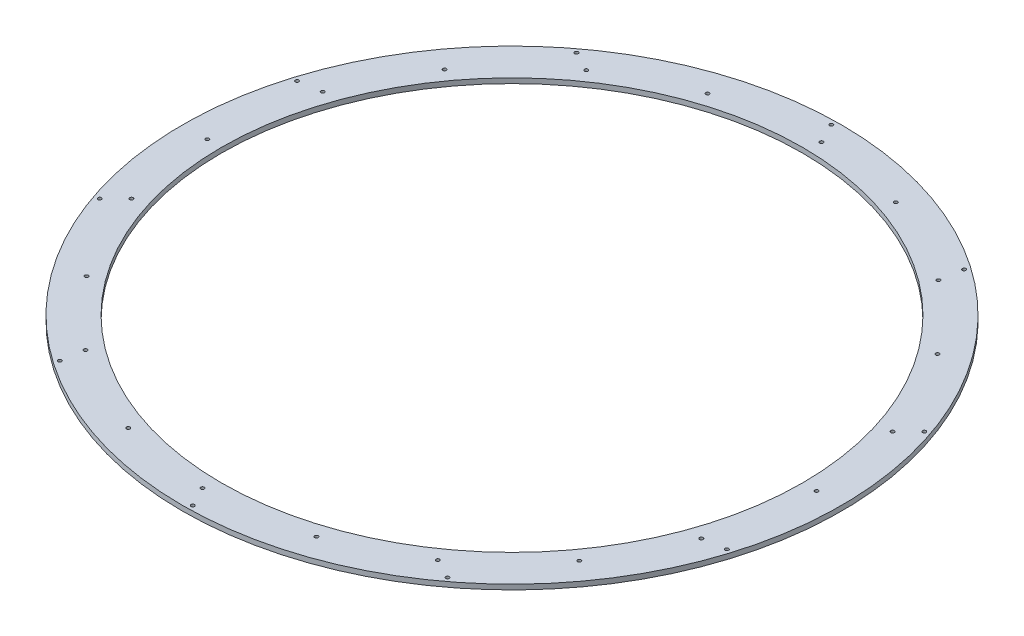
ISO-10303-21;
HEADER;
FILE_DESCRIPTION(('STEP AP214'),'2;1');
FILE_NAME('part.step','',(''),(''),'','','');
FILE_SCHEMA(('AUTOMOTIVE_DESIGN { 1 0 10303 214 1 1 1 1 }'));
ENDSEC;
DATA;
#1=APPLICATION_CONTEXT('core data for automotive mechanical design processes');
#2=APPLICATION_PROTOCOL_DEFINITION('international standard','automotive_design',2000,#1);
#3=PRODUCT_CONTEXT('',#1,'mechanical');
#4=PRODUCT('Part','Part','',(#3));
#5=PRODUCT_RELATED_PRODUCT_CATEGORY('part','',(#4));
#6=PRODUCT_DEFINITION_FORMATION('','',#4);
#7=PRODUCT_DEFINITION_CONTEXT('part definition',#1,'design');
#8=PRODUCT_DEFINITION('design','',#6,#7);
#9=PRODUCT_DEFINITION_SHAPE('','',#8);
#10=(LENGTH_UNIT() NAMED_UNIT(*) SI_UNIT(.MILLI.,.METRE.));
#11=(NAMED_UNIT(*) PLANE_ANGLE_UNIT() SI_UNIT($,.RADIAN.));
#12=(NAMED_UNIT(*) SI_UNIT($,.STERADIAN.) SOLID_ANGLE_UNIT());
#13=UNCERTAINTY_MEASURE_WITH_UNIT(LENGTH_MEASURE(1.E-05),#10,'distance_accuracy_value','');
#14=(GEOMETRIC_REPRESENTATION_CONTEXT(3) GLOBAL_UNCERTAINTY_ASSIGNED_CONTEXT((#13)) GLOBAL_UNIT_ASSIGNED_CONTEXT((#10,
#11,#12)) REPRESENTATION_CONTEXT('',''));
#15=CARTESIAN_POINT('',(0.,0.,0.));
#16=DIRECTION('',(0.,0.,1.));
#17=DIRECTION('',(1.,0.,0.));
#18=AXIS2_PLACEMENT_3D('',#15,#16,#17);
#19=CARTESIAN_POINT('',(0.,-5.,0.));
#20=DIRECTION('',(0.,1.,0.));
#21=DIRECTION('',(0.,0.,1.));
#22=AXIS2_PLACEMENT_3D('',#19,#20,#21);
#23=CYLINDRICAL_SURFACE('',#22,330.);
#24=CARTESIAN_POINT('',(0.,-5.,0.));
#25=DIRECTION('',(0.,1.,0.));
#26=DIRECTION('',(0.,0.,1.));
#27=AXIS2_PLACEMENT_3D('',#24,#25,#26);
#28=CIRCLE('',#27,330.);
#29=CARTESIAN_POINT('',(0.,-5.,330.));
#30=VERTEX_POINT('',#29);
#31=EDGE_CURVE('E10',#30,#30,#28,.T.);
#32=ORIENTED_EDGE('',*,*,#31,.T.);
#33=EDGE_LOOP('',(#32));
#34=FACE_BOUND('',#33,.T.);
#35=CARTESIAN_POINT('',(0.,0.,0.));
#36=DIRECTION('',(0.,1.,0.));
#37=DIRECTION('',(0.,0.,1.));
#38=AXIS2_PLACEMENT_3D('',#35,#36,#37);
#39=CIRCLE('',#38,330.);
#40=CARTESIAN_POINT('',(0.,0.,330.));
#41=VERTEX_POINT('',#40);
#42=EDGE_CURVE('E33',#41,#41,#39,.T.);
#43=ORIENTED_EDGE('',*,*,#42,.F.);
#44=EDGE_LOOP('',(#43));
#45=FACE_BOUND('',#44,.T.);
#46=ADVANCED_FACE('F30',(#34,#45),#23,.T.);
#47=CARTESIAN_POINT('',(0.,-5.,0.));
#48=DIRECTION('',(0.,1.,0.));
#49=DIRECTION('',(0.,0.,1.));
#50=AXIS2_PLACEMENT_3D('',#47,#48,#49);
#51=PLANE('',#50);
#52=CARTESIAN_POINT('',(-4.91615721260713,-5.,304.96037676764));
#53=DIRECTION('',(0.,1.,0.));
#54=DIRECTION('',(-0.587785252292462,0.,0.809016994374955));
#55=AXIS2_PLACEMENT_3D('',#52,#53,#54);
#56=CIRCLE('',#55,1.75000000000001);
#57=CARTESIAN_POINT('',(-5.94478140411895,-5.,306.376156507796));
#58=VERTEX_POINT('',#57);
#59=EDGE_CURVE('E219',#58,#58,#56,.T.);
#60=ORIENTED_EDGE('',*,*,#59,.T.);
#61=EDGE_LOOP('',(#60));
#62=FACE_BOUND('',#61,.T.);
#63=CARTESIAN_POINT('',(-94.250183284357,-5.,290.072237470022));
#64=DIRECTION('',(0.,1.,0.));
#65=DIRECTION('',(-0.587785252292462,0.,0.809016994374955));
#66=AXIS2_PLACEMENT_3D('',#63,#64,#65);
#67=CIRCLE('',#66,1.75);
#68=CARTESIAN_POINT('',(-95.2788074758688,-5.,291.488017210179));
#69=VERTEX_POINT('',#68);
#70=EDGE_CURVE('E213',#69,#69,#67,.T.);
#71=ORIENTED_EDGE('',*,*,#70,.T.);
#72=EDGE_LOOP('',(#71));
#73=FACE_BOUND('',#72,.T.);
#74=CARTESIAN_POINT('',(-186.767331512475,-5.,265.975494885731));
#75=DIRECTION('',(0.,1.,0.));
#76=DIRECTION('',(-0.587785252292462,0.,0.809016994374955));
#77=AXIS2_PLACEMENT_3D('',#74,#75,#76);
#78=CIRCLE('',#77,1.75);
#79=CARTESIAN_POINT('',(-187.795955703987,-5.,267.391274625887));
#80=VERTEX_POINT('',#79);
#81=EDGE_CURVE('E207',#80,#80,#78,.T.);
#82=ORIENTED_EDGE('',*,*,#81,.T.);
#83=EDGE_LOOP('',(#82));
#84=FACE_BOUND('',#83,.T.);
#85=CARTESIAN_POINT('',(-183.228466729594,-5.,243.828482708486));
#86=DIRECTION('',(0.,1.,0.));
#87=DIRECTION('',(-0.95105651629515,0.,0.309016994374958));
#88=AXIS2_PLACEMENT_3D('',#85,#86,#87);
#89=CIRCLE('',#88,1.75000000000001);
#90=CARTESIAN_POINT('',(-184.89281563311,-5.,244.369262448642));
#91=VERTEX_POINT('',#90);
#92=EDGE_CURVE('E201',#91,#91,#89,.T.);
#93=ORIENTED_EDGE('',*,*,#92,.T.);
#94=EDGE_LOOP('',(#93));
#95=FACE_BOUND('',#94,.T.);
#96=CARTESIAN_POINT('',(-246.750183284358,-5.,179.274501949206));
#97=DIRECTION('',(0.,1.,0.));
#98=DIRECTION('',(-0.95105651629515,0.,0.309016994374958));
#99=AXIS2_PLACEMENT_3D('',#96,#97,#98);
#100=CIRCLE('',#99,1.75);
#101=CARTESIAN_POINT('',(-248.414532187875,-5.,179.815281689362));
#102=VERTEX_POINT('',#101);
#103=EDGE_CURVE('E195',#102,#102,#100,.T.);
#104=ORIENTED_EDGE('',*,*,#103,.T.);
#105=EDGE_LOOP('',(#104));
#106=FACE_BOUND('',#105,.T.);
#107=CARTESIAN_POINT('',(-307.434418552677,-5.,105.39961237679));
#108=DIRECTION('',(0.,1.,0.));
#109=DIRECTION('',(-0.95105651629515,0.,0.309016994374958));
#110=AXIS2_PLACEMENT_3D('',#107,#108,#109);
#111=CIRCLE('',#110,1.75);
#112=CARTESIAN_POINT('',(-309.098767456193,-5.,105.940392116947));
#113=VERTEX_POINT('',#112);
#114=EDGE_CURVE('E189',#113,#113,#111,.T.);
#115=ORIENTED_EDGE('',*,*,#114,.T.);
#116=EDGE_LOOP('',(#115));
#117=FACE_BOUND('',#116,.T.);
#118=CARTESIAN_POINT('',(-291.553729662404,-5.,89.5623956800052));
#119=DIRECTION('',(0.,1.,0.));
#120=DIRECTION('',(-0.951056516295157,0.,-0.309016994374938));
#121=AXIS2_PLACEMENT_3D('',#118,#119,#120);
#122=CIRCLE('',#121,1.75000000000001);
#123=CARTESIAN_POINT('',(-293.218078565921,-5.,89.021615939849));
#124=VERTEX_POINT('',#123);
#125=EDGE_CURVE('E183',#124,#124,#122,.T.);
#126=ORIENTED_EDGE('',*,*,#125,.T.);
#127=EDGE_LOOP('',(#126));
#128=FACE_BOUND('',#127,.T.);
#129=CARTESIAN_POINT('',(-305.,-5.,9.85322934354826E-13));
#130=DIRECTION('',(0.,1.,0.));
#131=DIRECTION('',(-0.951056516295157,0.,-0.309016994374938));
#132=AXIS2_PLACEMENT_3D('',#129,#130,#131);
#133=CIRCLE('',#132,1.75);
#134=CARTESIAN_POINT('',(-306.664348903516,-5.,-0.540779740155156));
#135=VERTEX_POINT('',#134);
#136=EDGE_CURVE('E177',#135,#135,#133,.T.);
#137=ORIENTED_EDGE('',*,*,#136,.T.);
#138=EDGE_LOOP('',(#137));
#139=FACE_BOUND('',#138,.T.);
#140=CARTESIAN_POINT('',(-310.672007017316,-5.,-95.4353396590199));
#141=DIRECTION('',(0.,1.,0.));
#142=DIRECTION('',(-0.951056516295157,0.,-0.309016994374938));
#143=AXIS2_PLACEMENT_3D('',#140,#141,#142);
#144=CIRCLE('',#143,1.75);
#145=CARTESIAN_POINT('',(-312.336355920833,-5.,-95.9761193991761));
#146=VERTEX_POINT('',#145);
#147=EDGE_CURVE('E171',#146,#146,#144,.T.);
#148=ORIENTED_EDGE('',*,*,#147,.T.);
#149=EDGE_LOOP('',(#148));
#150=FACE_BOUND('',#149,.T.);
#151=CARTESIAN_POINT('',(-288.515377410974,-5.,-98.9134823843703));
#152=DIRECTION('',(0.,1.,0.));
#153=DIRECTION('',(-0.58778525229248,0.,-0.809016994374942));
#154=AXIS2_PLACEMENT_3D('',#151,#152,#153);
#155=CIRCLE('',#154,1.75000000000001);
#156=CARTESIAN_POINT('',(-289.544001602486,-5.,-100.329262124526));
#157=VERTEX_POINT('',#156);
#158=EDGE_CURVE('E165',#157,#157,#155,.T.);
#159=ORIENTED_EDGE('',*,*,#158,.T.);
#160=EDGE_LOOP('',(#159));
#161=FACE_BOUND('',#160,.T.);
#162=CARTESIAN_POINT('',(-246.750183284359,-5.,-179.274501949204));
#163=DIRECTION('',(0.,1.,0.));
#164=DIRECTION('',(-0.58778525229248,0.,-0.809016994374942));
#165=AXIS2_PLACEMENT_3D('',#162,#163,#164);
#166=CIRCLE('',#165,1.75);
#167=CARTESIAN_POINT('',(-247.778807475871,-5.,-180.69028168936));
#168=VERTEX_POINT('',#167);
#169=EDGE_CURVE('E159',#168,#168,#166,.T.);
#170=ORIENTED_EDGE('',*,*,#169,.T.);
#171=EDGE_LOOP('',(#170));
#172=FACE_BOUND('',#171,.T.);
#173=CARTESIAN_POINT('',(-195.243448154487,-5.,-259.817235672975));
#174=DIRECTION('',(0.,1.,0.));
#175=DIRECTION('',(-0.58778525229248,0.,-0.809016994374942));
#176=AXIS2_PLACEMENT_3D('',#173,#174,#175);
#177=CIRCLE('',#176,1.75);
#178=CARTESIAN_POINT('',(-196.272072345999,-5.,-261.233015413131));
#179=VERTEX_POINT('',#178);
#180=EDGE_CURVE('E153',#179,#179,#177,.T.);
#181=ORIENTED_EDGE('',*,*,#180,.T.);
#182=EDGE_LOOP('',(#181));
#183=FACE_BOUND('',#182,.T.);
#184=CARTESIAN_POINT('',(-175.273957265553,-5.,-249.607772123532));
#185=DIRECTION('',(0.,1.,0.));
#186=DIRECTION('',(0.,0.,-1.));
#187=AXIS2_PLACEMENT_3D('',#184,#185,#186);
#188=CIRCLE('',#187,1.75000000000001);
#189=CARTESIAN_POINT('',(-175.273957265553,-5.,-251.357772123532));
#190=VERTEX_POINT('',#189);
#191=EDGE_CURVE('E147',#190,#190,#188,.T.);
#192=ORIENTED_EDGE('',*,*,#191,.T.);
#193=EDGE_LOOP('',(#192));
#194=FACE_BOUND('',#193,.T.);
#195=CARTESIAN_POINT('',(-94.2501832843571,-5.,-290.072237470022));
#196=DIRECTION('',(0.,1.,0.));
#197=DIRECTION('',(0.,0.,-1.));
#198=AXIS2_PLACEMENT_3D('',#195,#196,#197);
#199=CIRCLE('',#198,1.75);
#200=CARTESIAN_POINT('',(-94.2501832843571,-5.,-291.822237470022));
#201=VERTEX_POINT('',#200);
#202=EDGE_CURVE('E141',#201,#201,#199,.T.);
#203=ORIENTED_EDGE('',*,*,#202,.T.);
#204=EDGE_LOOP('',(#203));
#205=FACE_BOUND('',#204,.T.);
#206=CARTESIAN_POINT('',(-5.23852817736839,-5.,-324.957778522895));
#207=DIRECTION('',(0.,1.,0.));
#208=DIRECTION('',(0.,0.,-1.));
#209=AXIS2_PLACEMENT_3D('',#206,#207,#208);
#210=CIRCLE('',#209,1.75);
#211=CARTESIAN_POINT('',(-5.23852817736839,-5.,-326.707778522895));
#212=VERTEX_POINT('',#211);
#213=EDGE_CURVE('E135',#212,#212,#210,.T.);
#214=ORIENTED_EDGE('',*,*,#213,.T.);
#215=EDGE_LOOP('',(#214));
#216=FACE_BOUND('',#215,.T.);
#217=CARTESIAN_POINT('',(4.91615721260943,-5.,-304.96037676764));
#218=DIRECTION('',(0.,1.,0.));
#219=DIRECTION('',(0.587785252292469,0.,-0.809016994374951));
#220=AXIS2_PLACEMENT_3D('',#217,#218,#219);
#221=CIRCLE('',#220,1.75000000000001);
#222=CARTESIAN_POINT('',(5.94478140412126,-5.,-306.376156507796));
#223=VERTEX_POINT('',#222);
#224=EDGE_CURVE('E129',#223,#223,#221,.T.);
#225=ORIENTED_EDGE('',*,*,#224,.T.);
#226=EDGE_LOOP('',(#225));
#227=FACE_BOUND('',#226,.T.);
#228=CARTESIAN_POINT('',(94.2501832843592,-5.,-290.072237470022));
#229=DIRECTION('',(0.,1.,0.));
#230=DIRECTION('',(0.587785252292469,0.,-0.809016994374951));
#231=AXIS2_PLACEMENT_3D('',#228,#229,#230);
#232=CIRCLE('',#231,1.75);
#233=CARTESIAN_POINT('',(95.278807475871,-5.,-291.488017210178));
#234=VERTEX_POINT('',#233);
#235=EDGE_CURVE('E123',#234,#234,#232,.T.);
#236=ORIENTED_EDGE('',*,*,#235,.T.);
#237=EDGE_LOOP('',(#236));
#238=FACE_BOUND('',#237,.T.);
#239=CARTESIAN_POINT('',(186.767331512477,-5.,-265.975494885729));
#240=DIRECTION('',(0.,1.,0.));
#241=DIRECTION('',(0.587785252292469,0.,-0.809016994374951));
#242=AXIS2_PLACEMENT_3D('',#239,#240,#241);
#243=CIRCLE('',#242,1.75);
#244=CARTESIAN_POINT('',(187.795955703989,-5.,-267.391274625885));
#245=VERTEX_POINT('',#244);
#246=EDGE_CURVE('E117',#245,#245,#243,.T.);
#247=ORIENTED_EDGE('',*,*,#246,.T.);
#248=EDGE_LOOP('',(#247));
#249=FACE_BOUND('',#248,.T.);
#250=CARTESIAN_POINT('',(183.228466729595,-5.,-243.828482708484));
#251=DIRECTION('',(0.,1.,0.));
#252=DIRECTION('',(0.951056516295152,0.,-0.309016994374952));
#253=AXIS2_PLACEMENT_3D('',#250,#251,#252);
#254=CIRCLE('',#253,1.75000000000001);
#255=CARTESIAN_POINT('',(184.892815633112,-5.,-244.369262448641));
#256=VERTEX_POINT('',#255);
#257=EDGE_CURVE('E111',#256,#256,#254,.T.);
#258=ORIENTED_EDGE('',*,*,#257,.T.);
#259=EDGE_LOOP('',(#258));
#260=FACE_BOUND('',#259,.T.);
#261=CARTESIAN_POINT('',(246.750183284359,-5.,-179.274501949204));
#262=DIRECTION('',(0.,1.,0.));
#263=DIRECTION('',(0.951056516295152,0.,-0.309016994374952));
#264=AXIS2_PLACEMENT_3D('',#261,#262,#263);
#265=CIRCLE('',#264,1.75);
#266=CARTESIAN_POINT('',(248.414532187876,-5.,-179.81528168936));
#267=VERTEX_POINT('',#266);
#268=EDGE_CURVE('E105',#267,#267,#265,.T.);
#269=ORIENTED_EDGE('',*,*,#268,.T.);
#270=EDGE_LOOP('',(#269));
#271=FACE_BOUND('',#270,.T.);
#272=CARTESIAN_POINT('',(307.434418552677,-5.,-105.399612376788));
#273=DIRECTION('',(0.,1.,0.));
#274=DIRECTION('',(0.951056516295152,0.,-0.309016994374952));
#275=AXIS2_PLACEMENT_3D('',#272,#273,#274);
#276=CIRCLE('',#275,1.75);
#277=CARTESIAN_POINT('',(309.098767456194,-5.,-105.940392116944));
#278=VERTEX_POINT('',#277);
#279=EDGE_CURVE('E99',#278,#278,#276,.T.);
#280=ORIENTED_EDGE('',*,*,#279,.T.);
#281=EDGE_LOOP('',(#280));
#282=FACE_BOUND('',#281,.T.);
#283=CARTESIAN_POINT('',(291.553729662405,-5.,-89.5623956800032));
#284=DIRECTION('',(0.,1.,0.));
#285=DIRECTION('',(0.951056516295155,0.,0.309016994374945));
#286=AXIS2_PLACEMENT_3D('',#283,#284,#285);
#287=CIRCLE('',#286,1.75000000000001);
#288=CARTESIAN_POINT('',(293.218078565921,-5.,-89.0216159398471));
#289=VERTEX_POINT('',#288);
#290=EDGE_CURVE('E93',#289,#289,#287,.T.);
#291=ORIENTED_EDGE('',*,*,#290,.T.);
#292=EDGE_LOOP('',(#291));
#293=FACE_BOUND('',#292,.T.);
#294=CARTESIAN_POINT('',(305.,-5.,1.08246744900953E-12));
#295=DIRECTION('',(0.,1.,0.));
#296=DIRECTION('',(0.951056516295155,0.,0.309016994374945));
#297=AXIS2_PLACEMENT_3D('',#294,#295,#296);
#298=CIRCLE('',#297,1.75);
#299=CARTESIAN_POINT('',(306.664348903517,-5.,0.540779740157235));
#300=VERTEX_POINT('',#299);
#301=EDGE_CURVE('E87',#300,#300,#298,.T.);
#302=ORIENTED_EDGE('',*,*,#301,.T.);
#303=EDGE_LOOP('',(#302));
#304=FACE_BOUND('',#303,.T.);
#305=CARTESIAN_POINT('',(310.672007017316,-5.,95.435339659022));
#306=DIRECTION('',(0.,1.,0.));
#307=DIRECTION('',(0.951056516295155,0.,0.309016994374945));
#308=AXIS2_PLACEMENT_3D('',#305,#306,#307);
#309=CIRCLE('',#308,1.75);
#310=CARTESIAN_POINT('',(312.336355920832,-5.,95.9761193991782));
#311=VERTEX_POINT('',#310);
#312=EDGE_CURVE('E81',#311,#311,#309,.T.);
#313=ORIENTED_EDGE('',*,*,#312,.T.);
#314=EDGE_LOOP('',(#313));
#315=FACE_BOUND('',#314,.T.);
#316=CARTESIAN_POINT('',(288.515377410973,-5.,98.9134823843725));
#317=DIRECTION('',(0.,1.,0.));
#318=DIRECTION('',(0.587785252292474,0.,0.809016994374947));
#319=AXIS2_PLACEMENT_3D('',#316,#317,#318);
#320=CIRCLE('',#319,1.75000000000001);
#321=CARTESIAN_POINT('',(289.544001602485,-5.,100.329262124529));
#322=VERTEX_POINT('',#321);
#323=EDGE_CURVE('E75',#322,#322,#320,.T.);
#324=ORIENTED_EDGE('',*,*,#323,.T.);
#325=EDGE_LOOP('',(#324));
#326=FACE_BOUND('',#325,.T.);
#327=CARTESIAN_POINT('',(246.750183284358,-5.,179.274501949206));
#328=DIRECTION('',(0.,1.,0.));
#329=DIRECTION('',(0.587785252292474,0.,0.809016994374947));
#330=AXIS2_PLACEMENT_3D('',#327,#328,#329);
#331=CIRCLE('',#330,1.75);
#332=CARTESIAN_POINT('',(247.77880747587,-5.,180.690281689362));
#333=VERTEX_POINT('',#332);
#334=EDGE_CURVE('E69',#333,#333,#331,.T.);
#335=ORIENTED_EDGE('',*,*,#334,.T.);
#336=EDGE_LOOP('',(#335));
#337=FACE_BOUND('',#336,.T.);
#338=CARTESIAN_POINT('',(195.243448154485,-5.,259.817235672976));
#339=DIRECTION('',(0.,1.,0.));
#340=DIRECTION('',(0.587785252292474,0.,0.809016994374947));
#341=AXIS2_PLACEMENT_3D('',#338,#339,#340);
#342=CIRCLE('',#341,1.75);
#343=CARTESIAN_POINT('',(196.272072345997,-5.,261.233015413133));
#344=VERTEX_POINT('',#343);
#345=EDGE_CURVE('E63',#344,#344,#342,.T.);
#346=ORIENTED_EDGE('',*,*,#345,.T.);
#347=EDGE_LOOP('',(#346));
#348=FACE_BOUND('',#347,.T.);
#349=CARTESIAN_POINT('',(175.273957265553,-5.,249.607772123532));
#350=DIRECTION('',(0.,1.,0.));
#351=DIRECTION('',(0.,0.,1.));
#352=AXIS2_PLACEMENT_3D('',#349,#350,#351);
#353=CIRCLE('',#352,1.75000000000001);
#354=CARTESIAN_POINT('',(175.273957265553,-5.,251.357772123532));
#355=VERTEX_POINT('',#354);
#356=EDGE_CURVE('E57',#355,#355,#353,.T.);
#357=ORIENTED_EDGE('',*,*,#356,.T.);
#358=EDGE_LOOP('',(#357));
#359=FACE_BOUND('',#358,.T.);
#360=CARTESIAN_POINT('',(94.2501832843571,-5.,290.072237470022));
#361=DIRECTION('',(0.,1.,0.));
#362=DIRECTION('',(0.,0.,1.));
#363=AXIS2_PLACEMENT_3D('',#360,#361,#362);
#364=CIRCLE('',#363,1.75);
#365=CARTESIAN_POINT('',(94.2501832843571,-5.,291.822237470022));
#366=VERTEX_POINT('',#365);
#367=EDGE_CURVE('E51',#366,#366,#364,.T.);
#368=ORIENTED_EDGE('',*,*,#367,.T.);
#369=EDGE_LOOP('',(#368));
#370=FACE_BOUND('',#369,.T.);
#371=CARTESIAN_POINT('',(5.23852817736839,-5.,324.957778522895));
#372=DIRECTION('',(0.,1.,0.));
#373=DIRECTION('',(0.,0.,1.));
#374=AXIS2_PLACEMENT_3D('',#371,#372,#373);
#375=CIRCLE('',#374,1.75);
#376=CARTESIAN_POINT('',(5.23852817736839,-5.,326.707778522895));
#377=VERTEX_POINT('',#376);
#378=EDGE_CURVE('E45',#377,#377,#375,.T.);
#379=ORIENTED_EDGE('',*,*,#378,.T.);
#380=EDGE_LOOP('',(#379));
#381=FACE_BOUND('',#380,.T.);
#382=CARTESIAN_POINT('',(0.,-5.,0.));
#383=DIRECTION('',(0.,1.,0.));
#384=DIRECTION('',(0.,0.,1.));
#385=AXIS2_PLACEMENT_3D('',#382,#383,#384);
#386=CIRCLE('',#385,291.);
#387=CARTESIAN_POINT('',(0.,-5.,291.));
#388=VERTEX_POINT('',#387);
#389=EDGE_CURVE('E40',#388,#388,#386,.T.);
#390=ORIENTED_EDGE('',*,*,#389,.T.);
#391=EDGE_LOOP('',(#390));
#392=FACE_BOUND('',#391,.T.);
#393=ORIENTED_EDGE('',*,*,#31,.F.);
#394=EDGE_LOOP('',(#393));
#395=FACE_BOUND('',#394,.T.);
#396=ADVANCED_FACE('F228',(#62,#73,#84,#95,#106,#117,#128,#139,#150,#161,#172,#183,#194,#205,
#216,#227,#238,#249,#260,#271,#282,#293,#304,#315,#326,#337,#348,#359,#370,#381,#392,#395),#51,.F.);
#397=CARTESIAN_POINT('',(0.,0.,0.));
#398=DIRECTION('',(0.,1.,0.));
#399=DIRECTION('',(0.,0.,1.));
#400=AXIS2_PLACEMENT_3D('',#397,#398,#399);
#401=PLANE('',#400);
#402=CARTESIAN_POINT('',(-4.91615721260713,0.,304.96037676764));
#403=DIRECTION('',(0.,1.,0.));
#404=DIRECTION('',(-0.587785252292462,0.,0.809016994374955));
#405=AXIS2_PLACEMENT_3D('',#402,#403,#404);
#406=CIRCLE('',#405,1.75000000000001);
#407=CARTESIAN_POINT('',(-5.94478140411895,0.,306.376156507796));
#408=VERTEX_POINT('',#407);
#409=EDGE_CURVE('E222',#408,#408,#406,.T.);
#410=ORIENTED_EDGE('',*,*,#409,.F.);
#411=EDGE_LOOP('',(#410));
#412=FACE_BOUND('',#411,.T.);
#413=CARTESIAN_POINT('',(-94.250183284357,0.,290.072237470022));
#414=DIRECTION('',(0.,1.,0.));
#415=DIRECTION('',(-0.587785252292462,0.,0.809016994374955));
#416=AXIS2_PLACEMENT_3D('',#413,#414,#415);
#417=CIRCLE('',#416,1.75);
#418=CARTESIAN_POINT('',(-95.2788074758688,0.,291.488017210179));
#419=VERTEX_POINT('',#418);
#420=EDGE_CURVE('E216',#419,#419,#417,.T.);
#421=ORIENTED_EDGE('',*,*,#420,.F.);
#422=EDGE_LOOP('',(#421));
#423=FACE_BOUND('',#422,.T.);
#424=CARTESIAN_POINT('',(-186.767331512475,0.,265.975494885731));
#425=DIRECTION('',(0.,1.,0.));
#426=DIRECTION('',(-0.587785252292462,0.,0.809016994374955));
#427=AXIS2_PLACEMENT_3D('',#424,#425,#426);
#428=CIRCLE('',#427,1.75);
#429=CARTESIAN_POINT('',(-187.795955703987,0.,267.391274625887));
#430=VERTEX_POINT('',#429);
#431=EDGE_CURVE('E210',#430,#430,#428,.T.);
#432=ORIENTED_EDGE('',*,*,#431,.F.);
#433=EDGE_LOOP('',(#432));
#434=FACE_BOUND('',#433,.T.);
#435=CARTESIAN_POINT('',(-183.228466729594,0.,243.828482708486));
#436=DIRECTION('',(0.,1.,0.));
#437=DIRECTION('',(-0.95105651629515,0.,0.309016994374958));
#438=AXIS2_PLACEMENT_3D('',#435,#436,#437);
#439=CIRCLE('',#438,1.75000000000001);
#440=CARTESIAN_POINT('',(-184.89281563311,0.,244.369262448642));
#441=VERTEX_POINT('',#440);
#442=EDGE_CURVE('E204',#441,#441,#439,.T.);
#443=ORIENTED_EDGE('',*,*,#442,.F.);
#444=EDGE_LOOP('',(#443));
#445=FACE_BOUND('',#444,.T.);
#446=CARTESIAN_POINT('',(-246.750183284358,0.,179.274501949206));
#447=DIRECTION('',(0.,1.,0.));
#448=DIRECTION('',(-0.95105651629515,0.,0.309016994374958));
#449=AXIS2_PLACEMENT_3D('',#446,#447,#448);
#450=CIRCLE('',#449,1.75);
#451=CARTESIAN_POINT('',(-248.414532187875,0.,179.815281689362));
#452=VERTEX_POINT('',#451);
#453=EDGE_CURVE('E198',#452,#452,#450,.T.);
#454=ORIENTED_EDGE('',*,*,#453,.F.);
#455=EDGE_LOOP('',(#454));
#456=FACE_BOUND('',#455,.T.);
#457=CARTESIAN_POINT('',(-307.434418552677,0.,105.39961237679));
#458=DIRECTION('',(0.,1.,0.));
#459=DIRECTION('',(-0.95105651629515,0.,0.309016994374958));
#460=AXIS2_PLACEMENT_3D('',#457,#458,#459);
#461=CIRCLE('',#460,1.75);
#462=CARTESIAN_POINT('',(-309.098767456193,0.,105.940392116947));
#463=VERTEX_POINT('',#462);
#464=EDGE_CURVE('E192',#463,#463,#461,.T.);
#465=ORIENTED_EDGE('',*,*,#464,.F.);
#466=EDGE_LOOP('',(#465));
#467=FACE_BOUND('',#466,.T.);
#468=CARTESIAN_POINT('',(-291.553729662404,0.,89.5623956800052));
#469=DIRECTION('',(0.,1.,0.));
#470=DIRECTION('',(-0.951056516295157,0.,-0.309016994374938));
#471=AXIS2_PLACEMENT_3D('',#468,#469,#470);
#472=CIRCLE('',#471,1.75000000000001);
#473=CARTESIAN_POINT('',(-293.218078565921,0.,89.021615939849));
#474=VERTEX_POINT('',#473);
#475=EDGE_CURVE('E186',#474,#474,#472,.T.);
#476=ORIENTED_EDGE('',*,*,#475,.F.);
#477=EDGE_LOOP('',(#476));
#478=FACE_BOUND('',#477,.T.);
#479=CARTESIAN_POINT('',(-305.,0.,9.85322934354826E-13));
#480=DIRECTION('',(0.,1.,0.));
#481=DIRECTION('',(-0.951056516295157,0.,-0.309016994374938));
#482=AXIS2_PLACEMENT_3D('',#479,#480,#481);
#483=CIRCLE('',#482,1.75);
#484=CARTESIAN_POINT('',(-306.664348903516,0.,-0.540779740155156));
#485=VERTEX_POINT('',#484);
#486=EDGE_CURVE('E180',#485,#485,#483,.T.);
#487=ORIENTED_EDGE('',*,*,#486,.F.);
#488=EDGE_LOOP('',(#487));
#489=FACE_BOUND('',#488,.T.);
#490=CARTESIAN_POINT('',(-310.672007017316,0.,-95.4353396590199));
#491=DIRECTION('',(0.,1.,0.));
#492=DIRECTION('',(-0.951056516295157,0.,-0.309016994374938));
#493=AXIS2_PLACEMENT_3D('',#490,#491,#492);
#494=CIRCLE('',#493,1.75);
#495=CARTESIAN_POINT('',(-312.336355920833,0.,-95.9761193991761));
#496=VERTEX_POINT('',#495);
#497=EDGE_CURVE('E174',#496,#496,#494,.T.);
#498=ORIENTED_EDGE('',*,*,#497,.F.);
#499=EDGE_LOOP('',(#498));
#500=FACE_BOUND('',#499,.T.);
#501=CARTESIAN_POINT('',(-288.515377410974,0.,-98.9134823843703));
#502=DIRECTION('',(0.,1.,0.));
#503=DIRECTION('',(-0.58778525229248,0.,-0.809016994374942));
#504=AXIS2_PLACEMENT_3D('',#501,#502,#503);
#505=CIRCLE('',#504,1.75000000000001);
#506=CARTESIAN_POINT('',(-289.544001602486,0.,-100.329262124526));
#507=VERTEX_POINT('',#506);
#508=EDGE_CURVE('E168',#507,#507,#505,.T.);
#509=ORIENTED_EDGE('',*,*,#508,.F.);
#510=EDGE_LOOP('',(#509));
#511=FACE_BOUND('',#510,.T.);
#512=CARTESIAN_POINT('',(-246.750183284359,0.,-179.274501949204));
#513=DIRECTION('',(0.,1.,0.));
#514=DIRECTION('',(-0.58778525229248,0.,-0.809016994374942));
#515=AXIS2_PLACEMENT_3D('',#512,#513,#514);
#516=CIRCLE('',#515,1.75);
#517=CARTESIAN_POINT('',(-247.778807475871,0.,-180.69028168936));
#518=VERTEX_POINT('',#517);
#519=EDGE_CURVE('E162',#518,#518,#516,.T.);
#520=ORIENTED_EDGE('',*,*,#519,.F.);
#521=EDGE_LOOP('',(#520));
#522=FACE_BOUND('',#521,.T.);
#523=CARTESIAN_POINT('',(-195.243448154487,0.,-259.817235672975));
#524=DIRECTION('',(0.,1.,0.));
#525=DIRECTION('',(-0.58778525229248,0.,-0.809016994374942));
#526=AXIS2_PLACEMENT_3D('',#523,#524,#525);
#527=CIRCLE('',#526,1.75);
#528=CARTESIAN_POINT('',(-196.272072345999,0.,-261.233015413131));
#529=VERTEX_POINT('',#528);
#530=EDGE_CURVE('E156',#529,#529,#527,.T.);
#531=ORIENTED_EDGE('',*,*,#530,.F.);
#532=EDGE_LOOP('',(#531));
#533=FACE_BOUND('',#532,.T.);
#534=CARTESIAN_POINT('',(-175.273957265553,0.,-249.607772123532));
#535=DIRECTION('',(0.,1.,0.));
#536=DIRECTION('',(0.,0.,-1.));
#537=AXIS2_PLACEMENT_3D('',#534,#535,#536);
#538=CIRCLE('',#537,1.75000000000001);
#539=CARTESIAN_POINT('',(-175.273957265553,0.,-251.357772123532));
#540=VERTEX_POINT('',#539);
#541=EDGE_CURVE('E150',#540,#540,#538,.T.);
#542=ORIENTED_EDGE('',*,*,#541,.F.);
#543=EDGE_LOOP('',(#542));
#544=FACE_BOUND('',#543,.T.);
#545=CARTESIAN_POINT('',(-94.2501832843571,0.,-290.072237470022));
#546=DIRECTION('',(0.,1.,0.));
#547=DIRECTION('',(0.,0.,-1.));
#548=AXIS2_PLACEMENT_3D('',#545,#546,#547);
#549=CIRCLE('',#548,1.75);
#550=CARTESIAN_POINT('',(-94.2501832843571,0.,-291.822237470022));
#551=VERTEX_POINT('',#550);
#552=EDGE_CURVE('E144',#551,#551,#549,.T.);
#553=ORIENTED_EDGE('',*,*,#552,.F.);
#554=EDGE_LOOP('',(#553));
#555=FACE_BOUND('',#554,.T.);
#556=CARTESIAN_POINT('',(-5.23852817736839,0.,-324.957778522895));
#557=DIRECTION('',(0.,1.,0.));
#558=DIRECTION('',(0.,0.,-1.));
#559=AXIS2_PLACEMENT_3D('',#556,#557,#558);
#560=CIRCLE('',#559,1.75);
#561=CARTESIAN_POINT('',(-5.23852817736839,0.,-326.707778522895));
#562=VERTEX_POINT('',#561);
#563=EDGE_CURVE('E138',#562,#562,#560,.T.);
#564=ORIENTED_EDGE('',*,*,#563,.F.);
#565=EDGE_LOOP('',(#564));
#566=FACE_BOUND('',#565,.T.);
#567=CARTESIAN_POINT('',(4.91615721260943,0.,-304.96037676764));
#568=DIRECTION('',(0.,1.,0.));
#569=DIRECTION('',(0.587785252292469,0.,-0.809016994374951));
#570=AXIS2_PLACEMENT_3D('',#567,#568,#569);
#571=CIRCLE('',#570,1.75000000000001);
#572=CARTESIAN_POINT('',(5.94478140412126,0.,-306.376156507796));
#573=VERTEX_POINT('',#572);
#574=EDGE_CURVE('E132',#573,#573,#571,.T.);
#575=ORIENTED_EDGE('',*,*,#574,.F.);
#576=EDGE_LOOP('',(#575));
#577=FACE_BOUND('',#576,.T.);
#578=CARTESIAN_POINT('',(94.2501832843592,0.,-290.072237470022));
#579=DIRECTION('',(0.,1.,0.));
#580=DIRECTION('',(0.587785252292469,0.,-0.809016994374951));
#581=AXIS2_PLACEMENT_3D('',#578,#579,#580);
#582=CIRCLE('',#581,1.75);
#583=CARTESIAN_POINT('',(95.278807475871,0.,-291.488017210178));
#584=VERTEX_POINT('',#583);
#585=EDGE_CURVE('E126',#584,#584,#582,.T.);
#586=ORIENTED_EDGE('',*,*,#585,.F.);
#587=EDGE_LOOP('',(#586));
#588=FACE_BOUND('',#587,.T.);
#589=CARTESIAN_POINT('',(186.767331512477,0.,-265.975494885729));
#590=DIRECTION('',(0.,1.,0.));
#591=DIRECTION('',(0.587785252292469,0.,-0.809016994374951));
#592=AXIS2_PLACEMENT_3D('',#589,#590,#591);
#593=CIRCLE('',#592,1.75);
#594=CARTESIAN_POINT('',(187.795955703989,0.,-267.391274625885));
#595=VERTEX_POINT('',#594);
#596=EDGE_CURVE('E120',#595,#595,#593,.T.);
#597=ORIENTED_EDGE('',*,*,#596,.F.);
#598=EDGE_LOOP('',(#597));
#599=FACE_BOUND('',#598,.T.);
#600=CARTESIAN_POINT('',(183.228466729595,0.,-243.828482708484));
#601=DIRECTION('',(0.,1.,0.));
#602=DIRECTION('',(0.951056516295152,0.,-0.309016994374952));
#603=AXIS2_PLACEMENT_3D('',#600,#601,#602);
#604=CIRCLE('',#603,1.75000000000001);
#605=CARTESIAN_POINT('',(184.892815633112,0.,-244.369262448641));
#606=VERTEX_POINT('',#605);
#607=EDGE_CURVE('E114',#606,#606,#604,.T.);
#608=ORIENTED_EDGE('',*,*,#607,.F.);
#609=EDGE_LOOP('',(#608));
#610=FACE_BOUND('',#609,.T.);
#611=CARTESIAN_POINT('',(246.750183284359,0.,-179.274501949204));
#612=DIRECTION('',(0.,1.,0.));
#613=DIRECTION('',(0.951056516295152,0.,-0.309016994374952));
#614=AXIS2_PLACEMENT_3D('',#611,#612,#613);
#615=CIRCLE('',#614,1.75);
#616=CARTESIAN_POINT('',(248.414532187876,0.,-179.81528168936));
#617=VERTEX_POINT('',#616);
#618=EDGE_CURVE('E108',#617,#617,#615,.T.);
#619=ORIENTED_EDGE('',*,*,#618,.F.);
#620=EDGE_LOOP('',(#619));
#621=FACE_BOUND('',#620,.T.);
#622=CARTESIAN_POINT('',(307.434418552677,0.,-105.399612376788));
#623=DIRECTION('',(0.,1.,0.));
#624=DIRECTION('',(0.951056516295152,0.,-0.309016994374952));
#625=AXIS2_PLACEMENT_3D('',#622,#623,#624);
#626=CIRCLE('',#625,1.75);
#627=CARTESIAN_POINT('',(309.098767456194,0.,-105.940392116944));
#628=VERTEX_POINT('',#627);
#629=EDGE_CURVE('E102',#628,#628,#626,.T.);
#630=ORIENTED_EDGE('',*,*,#629,.F.);
#631=EDGE_LOOP('',(#630));
#632=FACE_BOUND('',#631,.T.);
#633=CARTESIAN_POINT('',(291.553729662405,0.,-89.5623956800032));
#634=DIRECTION('',(0.,1.,0.));
#635=DIRECTION('',(0.951056516295155,0.,0.309016994374945));
#636=AXIS2_PLACEMENT_3D('',#633,#634,#635);
#637=CIRCLE('',#636,1.75000000000001);
#638=CARTESIAN_POINT('',(293.218078565921,0.,-89.0216159398471));
#639=VERTEX_POINT('',#638);
#640=EDGE_CURVE('E96',#639,#639,#637,.T.);
#641=ORIENTED_EDGE('',*,*,#640,.F.);
#642=EDGE_LOOP('',(#641));
#643=FACE_BOUND('',#642,.T.);
#644=CARTESIAN_POINT('',(305.,0.,1.08246744900953E-12));
#645=DIRECTION('',(0.,1.,0.));
#646=DIRECTION('',(0.951056516295155,0.,0.309016994374945));
#647=AXIS2_PLACEMENT_3D('',#644,#645,#646);
#648=CIRCLE('',#647,1.75);
#649=CARTESIAN_POINT('',(306.664348903517,0.,0.540779740157235));
#650=VERTEX_POINT('',#649);
#651=EDGE_CURVE('E90',#650,#650,#648,.T.);
#652=ORIENTED_EDGE('',*,*,#651,.F.);
#653=EDGE_LOOP('',(#652));
#654=FACE_BOUND('',#653,.T.);
#655=CARTESIAN_POINT('',(310.672007017316,0.,95.435339659022));
#656=DIRECTION('',(0.,1.,0.));
#657=DIRECTION('',(0.951056516295155,0.,0.309016994374945));
#658=AXIS2_PLACEMENT_3D('',#655,#656,#657);
#659=CIRCLE('',#658,1.75);
#660=CARTESIAN_POINT('',(312.336355920832,0.,95.9761193991782));
#661=VERTEX_POINT('',#660);
#662=EDGE_CURVE('E84',#661,#661,#659,.T.);
#663=ORIENTED_EDGE('',*,*,#662,.F.);
#664=EDGE_LOOP('',(#663));
#665=FACE_BOUND('',#664,.T.);
#666=CARTESIAN_POINT('',(288.515377410973,0.,98.9134823843725));
#667=DIRECTION('',(0.,1.,0.));
#668=DIRECTION('',(0.587785252292474,0.,0.809016994374947));
#669=AXIS2_PLACEMENT_3D('',#666,#667,#668);
#670=CIRCLE('',#669,1.75000000000001);
#671=CARTESIAN_POINT('',(289.544001602485,0.,100.329262124529));
#672=VERTEX_POINT('',#671);
#673=EDGE_CURVE('E78',#672,#672,#670,.T.);
#674=ORIENTED_EDGE('',*,*,#673,.F.);
#675=EDGE_LOOP('',(#674));
#676=FACE_BOUND('',#675,.T.);
#677=CARTESIAN_POINT('',(246.750183284358,0.,179.274501949206));
#678=DIRECTION('',(0.,1.,0.));
#679=DIRECTION('',(0.587785252292474,0.,0.809016994374947));
#680=AXIS2_PLACEMENT_3D('',#677,#678,#679);
#681=CIRCLE('',#680,1.75);
#682=CARTESIAN_POINT('',(247.77880747587,0.,180.690281689362));
#683=VERTEX_POINT('',#682);
#684=EDGE_CURVE('E72',#683,#683,#681,.T.);
#685=ORIENTED_EDGE('',*,*,#684,.F.);
#686=EDGE_LOOP('',(#685));
#687=FACE_BOUND('',#686,.T.);
#688=CARTESIAN_POINT('',(195.243448154485,0.,259.817235672976));
#689=DIRECTION('',(0.,1.,0.));
#690=DIRECTION('',(0.587785252292474,0.,0.809016994374947));
#691=AXIS2_PLACEMENT_3D('',#688,#689,#690);
#692=CIRCLE('',#691,1.75);
#693=CARTESIAN_POINT('',(196.272072345997,0.,261.233015413133));
#694=VERTEX_POINT('',#693);
#695=EDGE_CURVE('E66',#694,#694,#692,.T.);
#696=ORIENTED_EDGE('',*,*,#695,.F.);
#697=EDGE_LOOP('',(#696));
#698=FACE_BOUND('',#697,.T.);
#699=CARTESIAN_POINT('',(175.273957265553,0.,249.607772123532));
#700=DIRECTION('',(0.,1.,0.));
#701=DIRECTION('',(0.,0.,1.));
#702=AXIS2_PLACEMENT_3D('',#699,#700,#701);
#703=CIRCLE('',#702,1.75000000000001);
#704=CARTESIAN_POINT('',(175.273957265553,0.,251.357772123532));
#705=VERTEX_POINT('',#704);
#706=EDGE_CURVE('E60',#705,#705,#703,.T.);
#707=ORIENTED_EDGE('',*,*,#706,.F.);
#708=EDGE_LOOP('',(#707));
#709=FACE_BOUND('',#708,.T.);
#710=CARTESIAN_POINT('',(94.2501832843571,0.,290.072237470022));
#711=DIRECTION('',(0.,1.,0.));
#712=DIRECTION('',(0.,0.,1.));
#713=AXIS2_PLACEMENT_3D('',#710,#711,#712);
#714=CIRCLE('',#713,1.75);
#715=CARTESIAN_POINT('',(94.2501832843571,0.,291.822237470022));
#716=VERTEX_POINT('',#715);
#717=EDGE_CURVE('E54',#716,#716,#714,.T.);
#718=ORIENTED_EDGE('',*,*,#717,.F.);
#719=EDGE_LOOP('',(#718));
#720=FACE_BOUND('',#719,.T.);
#721=CARTESIAN_POINT('',(5.23852817736839,0.,324.957778522895));
#722=DIRECTION('',(0.,1.,0.));
#723=DIRECTION('',(0.,0.,1.));
#724=AXIS2_PLACEMENT_3D('',#721,#722,#723);
#725=CIRCLE('',#724,1.75);
#726=CARTESIAN_POINT('',(5.23852817736839,0.,326.707778522895));
#727=VERTEX_POINT('',#726);
#728=EDGE_CURVE('E48',#727,#727,#725,.T.);
#729=ORIENTED_EDGE('',*,*,#728,.F.);
#730=EDGE_LOOP('',(#729));
#731=FACE_BOUND('',#730,.T.);
#732=CARTESIAN_POINT('',(0.,0.,0.));
#733=DIRECTION('',(0.,1.,0.));
#734=DIRECTION('',(0.,0.,1.));
#735=AXIS2_PLACEMENT_3D('',#732,#733,#734);
#736=CIRCLE('',#735,291.);
#737=CARTESIAN_POINT('',(0.,0.,291.));
#738=VERTEX_POINT('',#737);
#739=EDGE_CURVE('E42',#738,#738,#736,.T.);
#740=ORIENTED_EDGE('',*,*,#739,.F.);
#741=EDGE_LOOP('',(#740));
#742=FACE_BOUND('',#741,.T.);
#743=ORIENTED_EDGE('',*,*,#42,.T.);
#744=EDGE_LOOP('',(#743));
#745=FACE_BOUND('',#744,.T.);
#746=ADVANCED_FACE('F238',(#412,#423,#434,#445,#456,#467,#478,#489,#500,#511,#522,#533,#544,
#555,#566,#577,#588,#599,#610,#621,#632,#643,#654,#665,#676,#687,#698,#709,#720,#731,#742,#745),
#401,.T.);
#747=CARTESIAN_POINT('',(0.,-5.,0.));
#748=DIRECTION('',(0.,1.,0.));
#749=DIRECTION('',(0.,0.,1.));
#750=AXIS2_PLACEMENT_3D('',#747,#748,#749);
#751=CYLINDRICAL_SURFACE('',#750,291.);
#752=ORIENTED_EDGE('',*,*,#389,.F.);
#753=EDGE_LOOP('',(#752));
#754=FACE_BOUND('',#753,.T.);
#755=ORIENTED_EDGE('',*,*,#739,.T.);
#756=EDGE_LOOP('',(#755));
#757=FACE_BOUND('',#756,.T.);
#758=ADVANCED_FACE('F241',(#754,#757),#751,.F.);
#759=CARTESIAN_POINT('',(5.23852817736839,-5.,324.957778522895));
#760=DIRECTION('',(0.,1.,0.));
#761=DIRECTION('',(0.,0.,1.));
#762=AXIS2_PLACEMENT_3D('',#759,#760,#761);
#763=CYLINDRICAL_SURFACE('',#762,1.75);
#764=ORIENTED_EDGE('',*,*,#378,.F.);
#765=EDGE_LOOP('',(#764));
#766=FACE_BOUND('',#765,.T.);
#767=ORIENTED_EDGE('',*,*,#728,.T.);
#768=EDGE_LOOP('',(#767));
#769=FACE_BOUND('',#768,.T.);
#770=ADVANCED_FACE('F314',(#766,#769),#763,.F.);
#771=CARTESIAN_POINT('',(94.2501832843571,-5.,290.072237470022));
#772=DIRECTION('',(0.,1.,0.));
#773=DIRECTION('',(0.,0.,1.));
#774=AXIS2_PLACEMENT_3D('',#771,#772,#773);
#775=CYLINDRICAL_SURFACE('',#774,1.75);
#776=ORIENTED_EDGE('',*,*,#367,.F.);
#777=EDGE_LOOP('',(#776));
#778=FACE_BOUND('',#777,.T.);
#779=ORIENTED_EDGE('',*,*,#717,.T.);
#780=EDGE_LOOP('',(#779));
#781=FACE_BOUND('',#780,.T.);
#782=ADVANCED_FACE('F318',(#778,#781),#775,.F.);
#783=CARTESIAN_POINT('',(175.273957265553,-5.,249.607772123532));
#784=DIRECTION('',(0.,1.,0.));
#785=DIRECTION('',(0.,0.,1.));
#786=AXIS2_PLACEMENT_3D('',#783,#784,#785);
#787=CYLINDRICAL_SURFACE('',#786,1.75000000000001);
#788=ORIENTED_EDGE('',*,*,#356,.F.);
#789=EDGE_LOOP('',(#788));
#790=FACE_BOUND('',#789,.T.);
#791=ORIENTED_EDGE('',*,*,#706,.T.);
#792=EDGE_LOOP('',(#791));
#793=FACE_BOUND('',#792,.T.);
#794=ADVANCED_FACE('F322',(#790,#793),#787,.F.);
#795=CARTESIAN_POINT('',(195.243448154485,-5.,259.817235672976));
#796=DIRECTION('',(0.,1.,0.));
#797=DIRECTION('',(0.,0.,1.));
#798=AXIS2_PLACEMENT_3D('',#795,#796,#797);
#799=CYLINDRICAL_SURFACE('',#798,1.75);
#800=ORIENTED_EDGE('',*,*,#345,.F.);
#801=EDGE_LOOP('',(#800));
#802=FACE_BOUND('',#801,.T.);
#803=ORIENTED_EDGE('',*,*,#695,.T.);
#804=EDGE_LOOP('',(#803));
#805=FACE_BOUND('',#804,.T.);
#806=ADVANCED_FACE('F326',(#802,#805),#799,.F.);
#807=CARTESIAN_POINT('',(246.750183284358,-5.,179.274501949206));
#808=DIRECTION('',(0.,1.,0.));
#809=DIRECTION('',(0.,0.,1.));
#810=AXIS2_PLACEMENT_3D('',#807,#808,#809);
#811=CYLINDRICAL_SURFACE('',#810,1.75);
#812=ORIENTED_EDGE('',*,*,#334,.F.);
#813=EDGE_LOOP('',(#812));
#814=FACE_BOUND('',#813,.T.);
#815=ORIENTED_EDGE('',*,*,#684,.T.);
#816=EDGE_LOOP('',(#815));
#817=FACE_BOUND('',#816,.T.);
#818=ADVANCED_FACE('F330',(#814,#817),#811,.F.);
#819=CARTESIAN_POINT('',(288.515377410973,-5.,98.9134823843725));
#820=DIRECTION('',(0.,1.,0.));
#821=DIRECTION('',(0.,0.,1.));
#822=AXIS2_PLACEMENT_3D('',#819,#820,#821);
#823=CYLINDRICAL_SURFACE('',#822,1.75000000000001);
#824=ORIENTED_EDGE('',*,*,#323,.F.);
#825=EDGE_LOOP('',(#824));
#826=FACE_BOUND('',#825,.T.);
#827=ORIENTED_EDGE('',*,*,#673,.T.);
#828=EDGE_LOOP('',(#827));
#829=FACE_BOUND('',#828,.T.);
#830=ADVANCED_FACE('F334',(#826,#829),#823,.F.);
#831=CARTESIAN_POINT('',(310.672007017316,-5.,95.435339659022));
#832=DIRECTION('',(0.,1.,0.));
#833=DIRECTION('',(0.,0.,1.));
#834=AXIS2_PLACEMENT_3D('',#831,#832,#833);
#835=CYLINDRICAL_SURFACE('',#834,1.75);
#836=ORIENTED_EDGE('',*,*,#312,.F.);
#837=EDGE_LOOP('',(#836));
#838=FACE_BOUND('',#837,.T.);
#839=ORIENTED_EDGE('',*,*,#662,.T.);
#840=EDGE_LOOP('',(#839));
#841=FACE_BOUND('',#840,.T.);
#842=ADVANCED_FACE('F338',(#838,#841),#835,.F.);
#843=CARTESIAN_POINT('',(305.,-5.,1.08246744900953E-12));
#844=DIRECTION('',(0.,1.,0.));
#845=DIRECTION('',(0.,0.,1.));
#846=AXIS2_PLACEMENT_3D('',#843,#844,#845);
#847=CYLINDRICAL_SURFACE('',#846,1.75);
#848=ORIENTED_EDGE('',*,*,#301,.F.);
#849=EDGE_LOOP('',(#848));
#850=FACE_BOUND('',#849,.T.);
#851=ORIENTED_EDGE('',*,*,#651,.T.);
#852=EDGE_LOOP('',(#851));
#853=FACE_BOUND('',#852,.T.);
#854=ADVANCED_FACE('F342',(#850,#853),#847,.F.);
#855=CARTESIAN_POINT('',(291.553729662405,-5.,-89.5623956800032));
#856=DIRECTION('',(0.,1.,0.));
#857=DIRECTION('',(0.,0.,1.));
#858=AXIS2_PLACEMENT_3D('',#855,#856,#857);
#859=CYLINDRICAL_SURFACE('',#858,1.75000000000001);
#860=ORIENTED_EDGE('',*,*,#290,.F.);
#861=EDGE_LOOP('',(#860));
#862=FACE_BOUND('',#861,.T.);
#863=ORIENTED_EDGE('',*,*,#640,.T.);
#864=EDGE_LOOP('',(#863));
#865=FACE_BOUND('',#864,.T.);
#866=ADVANCED_FACE('F346',(#862,#865),#859,.F.);
#867=CARTESIAN_POINT('',(307.434418552677,-5.,-105.399612376788));
#868=DIRECTION('',(0.,1.,0.));
#869=DIRECTION('',(0.,0.,1.));
#870=AXIS2_PLACEMENT_3D('',#867,#868,#869);
#871=CYLINDRICAL_SURFACE('',#870,1.75);
#872=ORIENTED_EDGE('',*,*,#279,.F.);
#873=EDGE_LOOP('',(#872));
#874=FACE_BOUND('',#873,.T.);
#875=ORIENTED_EDGE('',*,*,#629,.T.);
#876=EDGE_LOOP('',(#875));
#877=FACE_BOUND('',#876,.T.);
#878=ADVANCED_FACE('F350',(#874,#877),#871,.F.);
#879=CARTESIAN_POINT('',(246.750183284359,-5.,-179.274501949204));
#880=DIRECTION('',(0.,1.,0.));
#881=DIRECTION('',(0.,0.,1.));
#882=AXIS2_PLACEMENT_3D('',#879,#880,#881);
#883=CYLINDRICAL_SURFACE('',#882,1.75);
#884=ORIENTED_EDGE('',*,*,#268,.F.);
#885=EDGE_LOOP('',(#884));
#886=FACE_BOUND('',#885,.T.);
#887=ORIENTED_EDGE('',*,*,#618,.T.);
#888=EDGE_LOOP('',(#887));
#889=FACE_BOUND('',#888,.T.);
#890=ADVANCED_FACE('F354',(#886,#889),#883,.F.);
#891=CARTESIAN_POINT('',(183.228466729595,-5.,-243.828482708484));
#892=DIRECTION('',(0.,1.,0.));
#893=DIRECTION('',(0.,0.,1.));
#894=AXIS2_PLACEMENT_3D('',#891,#892,#893);
#895=CYLINDRICAL_SURFACE('',#894,1.75000000000001);
#896=ORIENTED_EDGE('',*,*,#257,.F.);
#897=EDGE_LOOP('',(#896));
#898=FACE_BOUND('',#897,.T.);
#899=ORIENTED_EDGE('',*,*,#607,.T.);
#900=EDGE_LOOP('',(#899));
#901=FACE_BOUND('',#900,.T.);
#902=ADVANCED_FACE('F358',(#898,#901),#895,.F.);
#903=CARTESIAN_POINT('',(186.767331512477,-5.,-265.975494885729));
#904=DIRECTION('',(0.,1.,0.));
#905=DIRECTION('',(0.,0.,1.));
#906=AXIS2_PLACEMENT_3D('',#903,#904,#905);
#907=CYLINDRICAL_SURFACE('',#906,1.75);
#908=ORIENTED_EDGE('',*,*,#246,.F.);
#909=EDGE_LOOP('',(#908));
#910=FACE_BOUND('',#909,.T.);
#911=ORIENTED_EDGE('',*,*,#596,.T.);
#912=EDGE_LOOP('',(#911));
#913=FACE_BOUND('',#912,.T.);
#914=ADVANCED_FACE('F362',(#910,#913),#907,.F.);
#915=CARTESIAN_POINT('',(94.2501832843592,-5.,-290.072237470022));
#916=DIRECTION('',(0.,1.,0.));
#917=DIRECTION('',(0.,0.,1.));
#918=AXIS2_PLACEMENT_3D('',#915,#916,#917);
#919=CYLINDRICAL_SURFACE('',#918,1.75);
#920=ORIENTED_EDGE('',*,*,#235,.F.);
#921=EDGE_LOOP('',(#920));
#922=FACE_BOUND('',#921,.T.);
#923=ORIENTED_EDGE('',*,*,#585,.T.);
#924=EDGE_LOOP('',(#923));
#925=FACE_BOUND('',#924,.T.);
#926=ADVANCED_FACE('F366',(#922,#925),#919,.F.);
#927=CARTESIAN_POINT('',(4.91615721260943,-5.,-304.96037676764));
#928=DIRECTION('',(0.,1.,0.));
#929=DIRECTION('',(0.,0.,1.));
#930=AXIS2_PLACEMENT_3D('',#927,#928,#929);
#931=CYLINDRICAL_SURFACE('',#930,1.75000000000001);
#932=ORIENTED_EDGE('',*,*,#224,.F.);
#933=EDGE_LOOP('',(#932));
#934=FACE_BOUND('',#933,.T.);
#935=ORIENTED_EDGE('',*,*,#574,.T.);
#936=EDGE_LOOP('',(#935));
#937=FACE_BOUND('',#936,.T.);
#938=ADVANCED_FACE('F370',(#934,#937),#931,.F.);
#939=CARTESIAN_POINT('',(-5.23852817736839,-5.,-324.957778522895));
#940=DIRECTION('',(0.,1.,0.));
#941=DIRECTION('',(0.,0.,1.));
#942=AXIS2_PLACEMENT_3D('',#939,#940,#941);
#943=CYLINDRICAL_SURFACE('',#942,1.75);
#944=ORIENTED_EDGE('',*,*,#213,.F.);
#945=EDGE_LOOP('',(#944));
#946=FACE_BOUND('',#945,.T.);
#947=ORIENTED_EDGE('',*,*,#563,.T.);
#948=EDGE_LOOP('',(#947));
#949=FACE_BOUND('',#948,.T.);
#950=ADVANCED_FACE('F374',(#946,#949),#943,.F.);
#951=CARTESIAN_POINT('',(-94.2501832843571,-5.,-290.072237470022));
#952=DIRECTION('',(0.,1.,0.));
#953=DIRECTION('',(0.,0.,1.));
#954=AXIS2_PLACEMENT_3D('',#951,#952,#953);
#955=CYLINDRICAL_SURFACE('',#954,1.75);
#956=ORIENTED_EDGE('',*,*,#202,.F.);
#957=EDGE_LOOP('',(#956));
#958=FACE_BOUND('',#957,.T.);
#959=ORIENTED_EDGE('',*,*,#552,.T.);
#960=EDGE_LOOP('',(#959));
#961=FACE_BOUND('',#960,.T.);
#962=ADVANCED_FACE('F378',(#958,#961),#955,.F.);
#963=CARTESIAN_POINT('',(-175.273957265553,-5.,-249.607772123532));
#964=DIRECTION('',(0.,1.,0.));
#965=DIRECTION('',(0.,0.,1.));
#966=AXIS2_PLACEMENT_3D('',#963,#964,#965);
#967=CYLINDRICAL_SURFACE('',#966,1.75000000000001);
#968=ORIENTED_EDGE('',*,*,#191,.F.);
#969=EDGE_LOOP('',(#968));
#970=FACE_BOUND('',#969,.T.);
#971=ORIENTED_EDGE('',*,*,#541,.T.);
#972=EDGE_LOOP('',(#971));
#973=FACE_BOUND('',#972,.T.);
#974=ADVANCED_FACE('F382',(#970,#973),#967,.F.);
#975=CARTESIAN_POINT('',(-195.243448154487,-5.,-259.817235672975));
#976=DIRECTION('',(0.,1.,0.));
#977=DIRECTION('',(0.,0.,1.));
#978=AXIS2_PLACEMENT_3D('',#975,#976,#977);
#979=CYLINDRICAL_SURFACE('',#978,1.75);
#980=ORIENTED_EDGE('',*,*,#180,.F.);
#981=EDGE_LOOP('',(#980));
#982=FACE_BOUND('',#981,.T.);
#983=ORIENTED_EDGE('',*,*,#530,.T.);
#984=EDGE_LOOP('',(#983));
#985=FACE_BOUND('',#984,.T.);
#986=ADVANCED_FACE('F386',(#982,#985),#979,.F.);
#987=CARTESIAN_POINT('',(-246.750183284359,-5.,-179.274501949204));
#988=DIRECTION('',(0.,1.,0.));
#989=DIRECTION('',(0.,0.,1.));
#990=AXIS2_PLACEMENT_3D('',#987,#988,#989);
#991=CYLINDRICAL_SURFACE('',#990,1.75);
#992=ORIENTED_EDGE('',*,*,#169,.F.);
#993=EDGE_LOOP('',(#992));
#994=FACE_BOUND('',#993,.T.);
#995=ORIENTED_EDGE('',*,*,#519,.T.);
#996=EDGE_LOOP('',(#995));
#997=FACE_BOUND('',#996,.T.);
#998=ADVANCED_FACE('F390',(#994,#997),#991,.F.);
#999=CARTESIAN_POINT('',(-288.515377410974,-5.,-98.9134823843703));
#1000=DIRECTION('',(0.,1.,0.));
#1001=DIRECTION('',(0.,0.,1.));
#1002=AXIS2_PLACEMENT_3D('',#999,#1000,#1001);
#1003=CYLINDRICAL_SURFACE('',#1002,1.75000000000001);
#1004=ORIENTED_EDGE('',*,*,#158,.F.);
#1005=EDGE_LOOP('',(#1004));
#1006=FACE_BOUND('',#1005,.T.);
#1007=ORIENTED_EDGE('',*,*,#508,.T.);
#1008=EDGE_LOOP('',(#1007));
#1009=FACE_BOUND('',#1008,.T.);
#1010=ADVANCED_FACE('F394',(#1006,#1009),#1003,.F.);
#1011=CARTESIAN_POINT('',(-310.672007017316,-5.,-95.4353396590199));
#1012=DIRECTION('',(0.,1.,0.));
#1013=DIRECTION('',(0.,0.,1.));
#1014=AXIS2_PLACEMENT_3D('',#1011,#1012,#1013);
#1015=CYLINDRICAL_SURFACE('',#1014,1.75);
#1016=ORIENTED_EDGE('',*,*,#147,.F.);
#1017=EDGE_LOOP('',(#1016));
#1018=FACE_BOUND('',#1017,.T.);
#1019=ORIENTED_EDGE('',*,*,#497,.T.);
#1020=EDGE_LOOP('',(#1019));
#1021=FACE_BOUND('',#1020,.T.);
#1022=ADVANCED_FACE('F398',(#1018,#1021),#1015,.F.);
#1023=CARTESIAN_POINT('',(-305.,-5.,9.85322934354826E-13));
#1024=DIRECTION('',(0.,1.,0.));
#1025=DIRECTION('',(0.,0.,1.));
#1026=AXIS2_PLACEMENT_3D('',#1023,#1024,#1025);
#1027=CYLINDRICAL_SURFACE('',#1026,1.75);
#1028=ORIENTED_EDGE('',*,*,#136,.F.);
#1029=EDGE_LOOP('',(#1028));
#1030=FACE_BOUND('',#1029,.T.);
#1031=ORIENTED_EDGE('',*,*,#486,.T.);
#1032=EDGE_LOOP('',(#1031));
#1033=FACE_BOUND('',#1032,.T.);
#1034=ADVANCED_FACE('F402',(#1030,#1033),#1027,.F.);
#1035=CARTESIAN_POINT('',(-291.553729662404,-5.,89.5623956800052));
#1036=DIRECTION('',(0.,1.,0.));
#1037=DIRECTION('',(0.,0.,1.));
#1038=AXIS2_PLACEMENT_3D('',#1035,#1036,#1037);
#1039=CYLINDRICAL_SURFACE('',#1038,1.75000000000001);
#1040=ORIENTED_EDGE('',*,*,#125,.F.);
#1041=EDGE_LOOP('',(#1040));
#1042=FACE_BOUND('',#1041,.T.);
#1043=ORIENTED_EDGE('',*,*,#475,.T.);
#1044=EDGE_LOOP('',(#1043));
#1045=FACE_BOUND('',#1044,.T.);
#1046=ADVANCED_FACE('F406',(#1042,#1045),#1039,.F.);
#1047=CARTESIAN_POINT('',(-307.434418552677,-5.,105.39961237679));
#1048=DIRECTION('',(0.,1.,0.));
#1049=DIRECTION('',(0.,0.,1.));
#1050=AXIS2_PLACEMENT_3D('',#1047,#1048,#1049);
#1051=CYLINDRICAL_SURFACE('',#1050,1.75);
#1052=ORIENTED_EDGE('',*,*,#114,.F.);
#1053=EDGE_LOOP('',(#1052));
#1054=FACE_BOUND('',#1053,.T.);
#1055=ORIENTED_EDGE('',*,*,#464,.T.);
#1056=EDGE_LOOP('',(#1055));
#1057=FACE_BOUND('',#1056,.T.);
#1058=ADVANCED_FACE('F410',(#1054,#1057),#1051,.F.);
#1059=CARTESIAN_POINT('',(-246.750183284358,-5.,179.274501949206));
#1060=DIRECTION('',(0.,1.,0.));
#1061=DIRECTION('',(0.,0.,1.));
#1062=AXIS2_PLACEMENT_3D('',#1059,#1060,#1061);
#1063=CYLINDRICAL_SURFACE('',#1062,1.75);
#1064=ORIENTED_EDGE('',*,*,#103,.F.);
#1065=EDGE_LOOP('',(#1064));
#1066=FACE_BOUND('',#1065,.T.);
#1067=ORIENTED_EDGE('',*,*,#453,.T.);
#1068=EDGE_LOOP('',(#1067));
#1069=FACE_BOUND('',#1068,.T.);
#1070=ADVANCED_FACE('F414',(#1066,#1069),#1063,.F.);
#1071=CARTESIAN_POINT('',(-183.228466729594,-5.,243.828482708486));
#1072=DIRECTION('',(0.,1.,0.));
#1073=DIRECTION('',(0.,0.,1.));
#1074=AXIS2_PLACEMENT_3D('',#1071,#1072,#1073);
#1075=CYLINDRICAL_SURFACE('',#1074,1.75000000000001);
#1076=ORIENTED_EDGE('',*,*,#92,.F.);
#1077=EDGE_LOOP('',(#1076));
#1078=FACE_BOUND('',#1077,.T.);
#1079=ORIENTED_EDGE('',*,*,#442,.T.);
#1080=EDGE_LOOP('',(#1079));
#1081=FACE_BOUND('',#1080,.T.);
#1082=ADVANCED_FACE('F418',(#1078,#1081),#1075,.F.);
#1083=CARTESIAN_POINT('',(-186.767331512475,-5.,265.975494885731));
#1084=DIRECTION('',(0.,1.,0.));
#1085=DIRECTION('',(0.,0.,1.));
#1086=AXIS2_PLACEMENT_3D('',#1083,#1084,#1085);
#1087=CYLINDRICAL_SURFACE('',#1086,1.75);
#1088=ORIENTED_EDGE('',*,*,#81,.F.);
#1089=EDGE_LOOP('',(#1088));
#1090=FACE_BOUND('',#1089,.T.);
#1091=ORIENTED_EDGE('',*,*,#431,.T.);
#1092=EDGE_LOOP('',(#1091));
#1093=FACE_BOUND('',#1092,.T.);
#1094=ADVANCED_FACE('F422',(#1090,#1093),#1087,.F.);
#1095=CARTESIAN_POINT('',(-94.250183284357,-5.,290.072237470022));
#1096=DIRECTION('',(0.,1.,0.));
#1097=DIRECTION('',(0.,0.,1.));
#1098=AXIS2_PLACEMENT_3D('',#1095,#1096,#1097);
#1099=CYLINDRICAL_SURFACE('',#1098,1.75);
#1100=ORIENTED_EDGE('',*,*,#70,.F.);
#1101=EDGE_LOOP('',(#1100));
#1102=FACE_BOUND('',#1101,.T.);
#1103=ORIENTED_EDGE('',*,*,#420,.T.);
#1104=EDGE_LOOP('',(#1103));
#1105=FACE_BOUND('',#1104,.T.);
#1106=ADVANCED_FACE('F234',(#1102,#1105),#1099,.F.);
#1107=CARTESIAN_POINT('',(-4.91615721260713,-5.,304.96037676764));
#1108=DIRECTION('',(0.,1.,0.));
#1109=DIRECTION('',(0.,0.,1.));
#1110=AXIS2_PLACEMENT_3D('',#1107,#1108,#1109);
#1111=CYLINDRICAL_SURFACE('',#1110,1.75000000000001);
#1112=ORIENTED_EDGE('',*,*,#59,.F.);
#1113=EDGE_LOOP('',(#1112));
#1114=FACE_BOUND('',#1113,.T.);
#1115=ORIENTED_EDGE('',*,*,#409,.T.);
#1116=EDGE_LOOP('',(#1115));
#1117=FACE_BOUND('',#1116,.T.);
#1118=ADVANCED_FACE('F231',(#1114,#1117),#1111,.F.);
#1119=CLOSED_SHELL('',(#46,#396,#746,#758,#770,#782,#794,#806,#818,#830,#842,#854,#866,#878,
#890,#902,#914,#926,#938,#950,#962,#974,#986,#998,#1010,#1022,#1034,#1046,#1058,#1070,#1082,
#1094,#1106,#1118));
#1120=MANIFOLD_SOLID_BREP('B2',#1119);
#1121=ADVANCED_BREP_SHAPE_REPRESENTATION('',(#18,#1120),#14);
#1122=SHAPE_DEFINITION_REPRESENTATION(#9,#1121);
ENDSEC;
END-ISO-10303-21;
